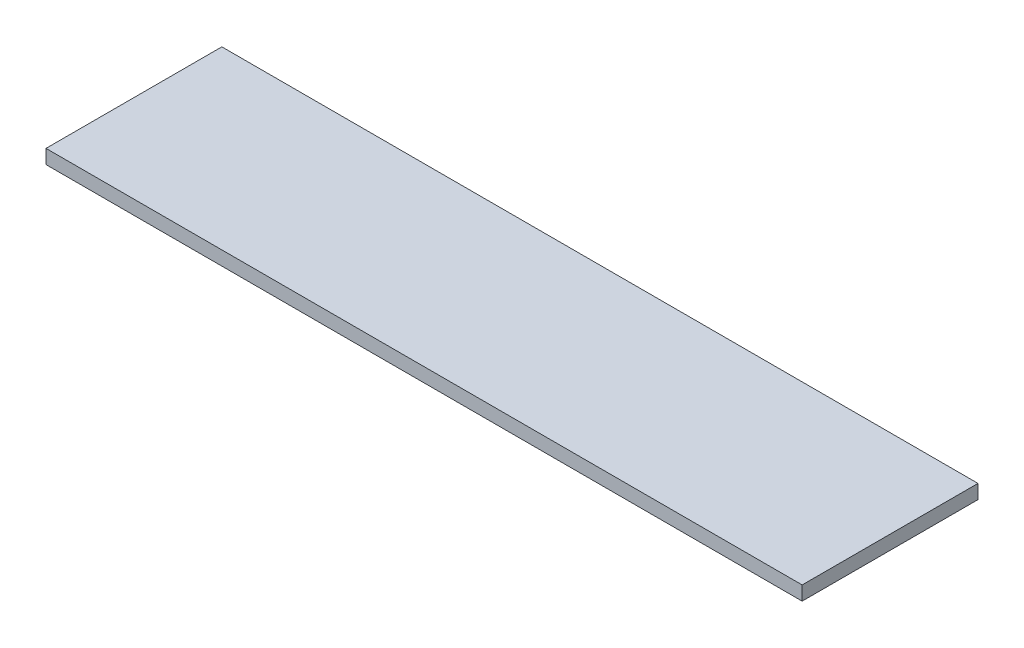
ISO-10303-21;
HEADER;
FILE_DESCRIPTION(('STEP AP214'),'2;1');
FILE_NAME('part.step','',(''),(''),'','','');
FILE_SCHEMA(('AUTOMOTIVE_DESIGN { 1 0 10303 214 1 1 1 1 }'));
ENDSEC;
DATA;
#1=APPLICATION_CONTEXT('core data for automotive mechanical design processes');
#2=APPLICATION_PROTOCOL_DEFINITION('international standard','automotive_design',2000,#1);
#3=PRODUCT_CONTEXT('',#1,'mechanical');
#4=PRODUCT('Part','Part','',(#3));
#5=PRODUCT_RELATED_PRODUCT_CATEGORY('part','',(#4));
#6=PRODUCT_DEFINITION_FORMATION('','',#4);
#7=PRODUCT_DEFINITION_CONTEXT('part definition',#1,'design');
#8=PRODUCT_DEFINITION('design','',#6,#7);
#9=PRODUCT_DEFINITION_SHAPE('','',#8);
#10=(LENGTH_UNIT() NAMED_UNIT(*) SI_UNIT(.MILLI.,.METRE.));
#11=(NAMED_UNIT(*) PLANE_ANGLE_UNIT() SI_UNIT($,.RADIAN.));
#12=(NAMED_UNIT(*) SI_UNIT($,.STERADIAN.) SOLID_ANGLE_UNIT());
#13=UNCERTAINTY_MEASURE_WITH_UNIT(LENGTH_MEASURE(1.E-05),#10,'distance_accuracy_value','');
#14=(GEOMETRIC_REPRESENTATION_CONTEXT(3) GLOBAL_UNCERTAINTY_ASSIGNED_CONTEXT((#13)) GLOBAL_UNIT_ASSIGNED_CONTEXT((#10,
#11,#12)) REPRESENTATION_CONTEXT('',''));
#15=CARTESIAN_POINT('',(0.,0.,0.));
#16=DIRECTION('',(0.,0.,1.));
#17=DIRECTION('',(1.,0.,0.));
#18=AXIS2_PLACEMENT_3D('',#15,#16,#17);
#19=CARTESIAN_POINT('',(136.525,2.54,31.75));
#20=DIRECTION('',(-1.,0.,0.));
#21=DIRECTION('',(0.,0.,1.));
#22=AXIS2_PLACEMENT_3D('',#19,#20,#21);
#23=PLANE('',#22);
#24=DIRECTION('',(0.,0.,-1.));
#25=VECTOR('',#24,1.);
#26=CARTESIAN_POINT('',(136.525,-2.54,31.75));
#27=LINE('',#26,#25);
#28=CARTESIAN_POINT('',(136.525,-2.54,31.75));
#29=VERTEX_POINT('',#28);
#30=CARTESIAN_POINT('',(136.525,-2.54,-31.75));
#31=VERTEX_POINT('',#30);
#32=EDGE_CURVE('E111',#29,#31,#27,.T.);
#33=ORIENTED_EDGE('',*,*,#32,.T.);
#34=DIRECTION('',(0.,-1.,0.));
#35=VECTOR('',#34,1.);
#36=CARTESIAN_POINT('',(136.525,2.54,-31.75));
#37=LINE('',#36,#35);
#38=CARTESIAN_POINT('',(136.525,2.54,-31.75));
#39=VERTEX_POINT('',#38);
#40=EDGE_CURVE('E11',#39,#31,#37,.T.);
#41=ORIENTED_EDGE('',*,*,#40,.F.);
#42=DIRECTION('',(0.,0.,-1.));
#43=VECTOR('',#42,1.);
#44=CARTESIAN_POINT('',(136.525,2.54,31.75));
#45=LINE('',#44,#43);
#46=CARTESIAN_POINT('',(136.525,2.54,31.75));
#47=VERTEX_POINT('',#46);
#48=EDGE_CURVE('E95',#47,#39,#45,.T.);
#49=ORIENTED_EDGE('',*,*,#48,.F.);
#50=DIRECTION('',(0.,-1.,0.));
#51=VECTOR('',#50,1.);
#52=CARTESIAN_POINT('',(136.525,2.54,31.75));
#53=LINE('',#52,#51);
#54=EDGE_CURVE('E107',#47,#29,#53,.T.);
#55=ORIENTED_EDGE('',*,*,#54,.T.);
#56=EDGE_LOOP('',(#33,#41,#49,#55));
#57=FACE_BOUND('',#56,.T.);
#58=ADVANCED_FACE('F43',(#57),#23,.F.);
#59=CARTESIAN_POINT('',(-136.525,2.54,-31.75));
#60=DIRECTION('',(0.,0.,1.));
#61=DIRECTION('',(1.,0.,0.));
#62=AXIS2_PLACEMENT_3D('',#59,#60,#61);
#63=PLANE('',#62);
#64=DIRECTION('',(-1.,0.,0.));
#65=VECTOR('',#64,1.);
#66=CARTESIAN_POINT('',(-136.525,-2.54,-31.75));
#67=LINE('',#66,#65);
#68=CARTESIAN_POINT('',(-136.525,-2.54,-31.75));
#69=VERTEX_POINT('',#68);
#70=EDGE_CURVE('E100',#31,#69,#67,.T.);
#71=ORIENTED_EDGE('',*,*,#70,.T.);
#72=DIRECTION('',(0.,-1.,0.));
#73=VECTOR('',#72,1.);
#74=CARTESIAN_POINT('',(-136.525,2.54,-31.75));
#75=LINE('',#74,#73);
#76=CARTESIAN_POINT('',(-136.525,2.54,-31.75));
#77=VERTEX_POINT('',#76);
#78=EDGE_CURVE('E52',#77,#69,#75,.T.);
#79=ORIENTED_EDGE('',*,*,#78,.F.);
#80=DIRECTION('',(-1.,0.,0.));
#81=VECTOR('',#80,1.);
#82=CARTESIAN_POINT('',(-136.525,2.54,-31.75));
#83=LINE('',#82,#81);
#84=EDGE_CURVE('E90',#39,#77,#83,.T.);
#85=ORIENTED_EDGE('',*,*,#84,.F.);
#86=ORIENTED_EDGE('',*,*,#40,.T.);
#87=EDGE_LOOP('',(#71,#79,#85,#86));
#88=FACE_BOUND('',#87,.T.);
#89=ADVANCED_FACE('F99',(#88),#63,.F.);
#90=CARTESIAN_POINT('',(-136.525,2.54,31.75));
#91=DIRECTION('',(1.,0.,0.));
#92=DIRECTION('',(0.,0.,-1.));
#93=AXIS2_PLACEMENT_3D('',#90,#91,#92);
#94=PLANE('',#93);
#95=DIRECTION('',(0.,0.,1.));
#96=VECTOR('',#95,1.);
#97=CARTESIAN_POINT('',(-136.525,-2.54,31.75));
#98=LINE('',#97,#96);
#99=CARTESIAN_POINT('',(-136.525,-2.54,31.75));
#100=VERTEX_POINT('',#99);
#101=EDGE_CURVE('E77',#69,#100,#98,.T.);
#102=ORIENTED_EDGE('',*,*,#101,.T.);
#103=DIRECTION('',(0.,-1.,0.));
#104=VECTOR('',#103,1.);
#105=CARTESIAN_POINT('',(-136.525,2.54,31.75));
#106=LINE('',#105,#104);
#107=CARTESIAN_POINT('',(-136.525,2.54,31.75));
#108=VERTEX_POINT('',#107);
#109=EDGE_CURVE('E102',#108,#100,#106,.T.);
#110=ORIENTED_EDGE('',*,*,#109,.F.);
#111=DIRECTION('',(0.,0.,1.));
#112=VECTOR('',#111,1.);
#113=CARTESIAN_POINT('',(-136.525,2.54,31.75));
#114=LINE('',#113,#112);
#115=EDGE_CURVE('E93',#77,#108,#114,.T.);
#116=ORIENTED_EDGE('',*,*,#115,.F.);
#117=ORIENTED_EDGE('',*,*,#78,.T.);
#118=EDGE_LOOP('',(#102,#110,#116,#117));
#119=FACE_BOUND('',#118,.T.);
#120=ADVANCED_FACE('F103',(#119),#94,.F.);
#121=CARTESIAN_POINT('',(-136.525,2.54,31.75));
#122=DIRECTION('',(0.,0.,-1.));
#123=DIRECTION('',(-1.,0.,0.));
#124=AXIS2_PLACEMENT_3D('',#121,#122,#123);
#125=PLANE('',#124);
#126=DIRECTION('',(1.,0.,0.));
#127=VECTOR('',#126,1.);
#128=CARTESIAN_POINT('',(-136.525,-2.54,31.75));
#129=LINE('',#128,#127);
#130=EDGE_CURVE('E83',#100,#29,#129,.T.);
#131=ORIENTED_EDGE('',*,*,#130,.T.);
#132=ORIENTED_EDGE('',*,*,#54,.F.);
#133=DIRECTION('',(1.,0.,0.));
#134=VECTOR('',#133,1.);
#135=CARTESIAN_POINT('',(-136.525,2.54,31.75));
#136=LINE('',#135,#134);
#137=EDGE_CURVE('E60',#108,#47,#136,.T.);
#138=ORIENTED_EDGE('',*,*,#137,.F.);
#139=ORIENTED_EDGE('',*,*,#109,.T.);
#140=EDGE_LOOP('',(#131,#132,#138,#139));
#141=FACE_BOUND('',#140,.T.);
#142=ADVANCED_FACE('F124',(#141),#125,.F.);
#143=CARTESIAN_POINT('',(0.,2.54,0.));
#144=DIRECTION('',(0.,-1.,0.));
#145=DIRECTION('',(0.,0.,-1.));
#146=AXIS2_PLACEMENT_3D('',#143,#144,#145);
#147=PLANE('',#146);
#148=ORIENTED_EDGE('',*,*,#48,.T.);
#149=ORIENTED_EDGE('',*,*,#84,.T.);
#150=ORIENTED_EDGE('',*,*,#115,.T.);
#151=ORIENTED_EDGE('',*,*,#137,.T.);
#152=EDGE_LOOP('',(#148,#149,#150,#151));
#153=FACE_BOUND('',#152,.T.);
#154=ADVANCED_FACE('F91',(#153),#147,.F.);
#155=CARTESIAN_POINT('',(0.,-2.54,0.));
#156=DIRECTION('',(0.,-1.,0.));
#157=DIRECTION('',(0.,0.,-1.));
#158=AXIS2_PLACEMENT_3D('',#155,#156,#157);
#159=PLANE('',#158);
#160=ORIENTED_EDGE('',*,*,#32,.F.);
#161=ORIENTED_EDGE('',*,*,#130,.F.);
#162=ORIENTED_EDGE('',*,*,#101,.F.);
#163=ORIENTED_EDGE('',*,*,#70,.F.);
#164=EDGE_LOOP('',(#160,#161,#162,#163));
#165=FACE_BOUND('',#164,.T.);
#166=ADVANCED_FACE('F127',(#165),#159,.T.);
#167=CLOSED_SHELL('',(#58,#89,#120,#142,#154,#166));
#168=MANIFOLD_SOLID_BREP('B2',#167);
#169=ADVANCED_BREP_SHAPE_REPRESENTATION('',(#18,#168),#14);
#170=SHAPE_DEFINITION_REPRESENTATION(#9,#169);
ENDSEC;
END-ISO-10303-21;
